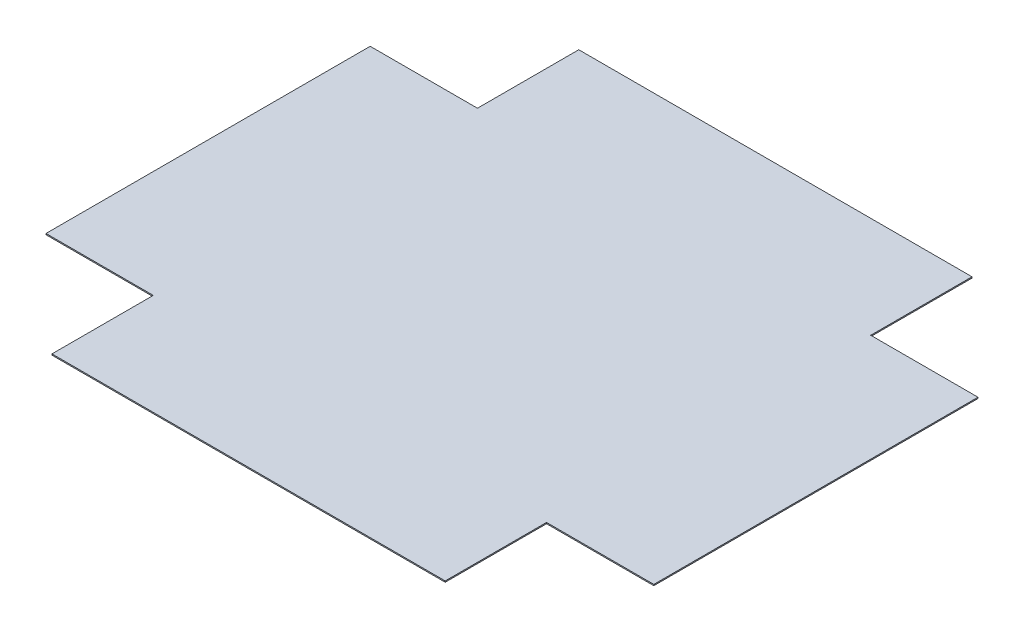
ISO-10303-21;
HEADER;
FILE_DESCRIPTION(('STEP AP214'),'2;1');
FILE_NAME('part.step','',(''),(''),'','','');
FILE_SCHEMA(('AUTOMOTIVE_DESIGN { 1 0 10303 214 1 1 1 1 }'));
ENDSEC;
DATA;
#1=APPLICATION_CONTEXT('core data for automotive mechanical design processes');
#2=APPLICATION_PROTOCOL_DEFINITION('international standard','automotive_design',2000,#1);
#3=PRODUCT_CONTEXT('',#1,'mechanical');
#4=PRODUCT('Part','Part','',(#3));
#5=PRODUCT_RELATED_PRODUCT_CATEGORY('part','',(#4));
#6=PRODUCT_DEFINITION_FORMATION('','',#4);
#7=PRODUCT_DEFINITION_CONTEXT('part definition',#1,'design');
#8=PRODUCT_DEFINITION('design','',#6,#7);
#9=PRODUCT_DEFINITION_SHAPE('','',#8);
#10=(LENGTH_UNIT() NAMED_UNIT(*) SI_UNIT(.MILLI.,.METRE.));
#11=(NAMED_UNIT(*) PLANE_ANGLE_UNIT() SI_UNIT($,.RADIAN.));
#12=(NAMED_UNIT(*) SI_UNIT($,.STERADIAN.) SOLID_ANGLE_UNIT());
#13=UNCERTAINTY_MEASURE_WITH_UNIT(LENGTH_MEASURE(1.E-05),#10,'distance_accuracy_value','');
#14=(GEOMETRIC_REPRESENTATION_CONTEXT(3) GLOBAL_UNCERTAINTY_ASSIGNED_CONTEXT((#13)) GLOBAL_UNIT_ASSIGNED_CONTEXT((#10,
#11,#12)) REPRESENTATION_CONTEXT('',''));
#15=CARTESIAN_POINT('',(0.,0.,0.));
#16=DIRECTION('',(0.,0.,1.));
#17=DIRECTION('',(1.,0.,0.));
#18=AXIS2_PLACEMENT_3D('',#15,#16,#17);
#19=CARTESIAN_POINT('',(127.,-0.7366,-101.6));
#20=DIRECTION('',(0.,0.,-1.));
#21=DIRECTION('',(-1.,0.,0.));
#22=AXIS2_PLACEMENT_3D('',#19,#20,#21);
#23=PLANE('',#22);
#24=DIRECTION('',(-1.,0.,0.));
#25=VECTOR('',#24,1.);
#26=CARTESIAN_POINT('',(127.,0.,-101.6));
#27=LINE('',#26,#25);
#28=CARTESIAN_POINT('',(190.5,0.,-101.6));
#29=VERTEX_POINT('',#28);
#30=CARTESIAN_POINT('',(123.25,0.,-101.6));
#31=VERTEX_POINT('',#30);
#32=EDGE_CURVE('E187',#29,#31,#27,.T.);
#33=ORIENTED_EDGE('',*,*,#32,.F.);
#34=DIRECTION('',(0.,1.,0.));
#35=VECTOR('',#34,1.);
#36=CARTESIAN_POINT('',(190.5,-0.7366,-101.6));
#37=LINE('',#36,#35);
#38=CARTESIAN_POINT('',(190.5,-0.7366,-101.6));
#39=VERTEX_POINT('',#38);
#40=EDGE_CURVE('E11',#39,#29,#37,.T.);
#41=ORIENTED_EDGE('',*,*,#40,.F.);
#42=DIRECTION('',(-1.,0.,0.));
#43=VECTOR('',#42,1.);
#44=CARTESIAN_POINT('',(127.,-0.7366,-101.6));
#45=LINE('',#44,#43);
#46=CARTESIAN_POINT('',(123.25,-0.7366,-101.6));
#47=VERTEX_POINT('',#46);
#48=EDGE_CURVE('E54',#39,#47,#45,.T.);
#49=ORIENTED_EDGE('',*,*,#48,.T.);
#50=DIRECTION('',(0.,1.,0.));
#51=VECTOR('',#50,1.);
#52=CARTESIAN_POINT('',(123.25,-0.7366,-101.6));
#53=LINE('',#52,#51);
#54=EDGE_CURVE('E39',#47,#31,#53,.T.);
#55=ORIENTED_EDGE('',*,*,#54,.T.);
#56=EDGE_LOOP('',(#33,#41,#49,#55));
#57=FACE_BOUND('',#56,.T.);
#58=ADVANCED_FACE('F35',(#57),#23,.T.);
#59=CARTESIAN_POINT('',(190.5,-0.7366,-101.6));
#60=DIRECTION('',(1.,0.,0.));
#61=DIRECTION('',(0.,0.,-1.));
#62=AXIS2_PLACEMENT_3D('',#59,#60,#61);
#63=PLANE('',#62);
#64=DIRECTION('',(0.,0.,-1.));
#65=VECTOR('',#64,1.);
#66=CARTESIAN_POINT('',(190.5,0.,-101.6));
#67=LINE('',#66,#65);
#68=CARTESIAN_POINT('',(190.5,0.,101.6));
#69=VERTEX_POINT('',#68);
#70=EDGE_CURVE('E185',#69,#29,#67,.T.);
#71=ORIENTED_EDGE('',*,*,#70,.F.);
#72=DIRECTION('',(0.,1.,0.));
#73=VECTOR('',#72,1.);
#74=CARTESIAN_POINT('',(190.5,-0.7366,101.6));
#75=LINE('',#74,#73);
#76=CARTESIAN_POINT('',(190.5,-0.7366,101.6));
#77=VERTEX_POINT('',#76);
#78=EDGE_CURVE('E45',#77,#69,#75,.T.);
#79=ORIENTED_EDGE('',*,*,#78,.F.);
#80=DIRECTION('',(0.,0.,-1.));
#81=VECTOR('',#80,1.);
#82=CARTESIAN_POINT('',(190.5,-0.7366,-101.6));
#83=LINE('',#82,#81);
#84=EDGE_CURVE('E148',#77,#39,#83,.T.);
#85=ORIENTED_EDGE('',*,*,#84,.T.);
#86=ORIENTED_EDGE('',*,*,#40,.T.);
#87=EDGE_LOOP('',(#71,#79,#85,#86));
#88=FACE_BOUND('',#87,.T.);
#89=ADVANCED_FACE('F210',(#88),#63,.T.);
#90=CARTESIAN_POINT('',(190.5,-0.7366,101.6));
#91=DIRECTION('',(0.,0.,1.));
#92=DIRECTION('',(1.,0.,0.));
#93=AXIS2_PLACEMENT_3D('',#90,#91,#92);
#94=PLANE('',#93);
#95=DIRECTION('',(1.,0.,0.));
#96=VECTOR('',#95,1.);
#97=CARTESIAN_POINT('',(190.5,0.,101.6));
#98=LINE('',#97,#96);
#99=CARTESIAN_POINT('',(123.25,0.,101.6));
#100=VERTEX_POINT('',#99);
#101=EDGE_CURVE('E136',#100,#69,#98,.T.);
#102=ORIENTED_EDGE('',*,*,#101,.F.);
#103=DIRECTION('',(0.,1.,0.));
#104=VECTOR('',#103,1.);
#105=CARTESIAN_POINT('',(123.25,-0.7366,101.6));
#106=LINE('',#105,#104);
#107=CARTESIAN_POINT('',(123.25,-0.7366,101.6));
#108=VERTEX_POINT('',#107);
#109=EDGE_CURVE('E131',#108,#100,#106,.T.);
#110=ORIENTED_EDGE('',*,*,#109,.F.);
#111=DIRECTION('',(1.,0.,0.));
#112=VECTOR('',#111,1.);
#113=CARTESIAN_POINT('',(127.,-0.7366,101.6));
#114=LINE('',#113,#112);
#115=EDGE_CURVE('E134',#108,#77,#114,.T.);
#116=ORIENTED_EDGE('',*,*,#115,.T.);
#117=ORIENTED_EDGE('',*,*,#78,.T.);
#118=EDGE_LOOP('',(#102,#110,#116,#117));
#119=FACE_BOUND('',#118,.T.);
#120=ADVANCED_FACE('F133',(#119),#94,.T.);
#121=CARTESIAN_POINT('',(123.25,-0.7366,101.6));
#122=DIRECTION('',(1.,0.,0.));
#123=DIRECTION('',(0.,0.,-1.));
#124=AXIS2_PLACEMENT_3D('',#121,#122,#123);
#125=PLANE('',#124);
#126=DIRECTION('',(0.,0.,-1.));
#127=VECTOR('',#126,1.);
#128=CARTESIAN_POINT('',(123.25,0.,101.6));
#129=LINE('',#128,#127);
#130=CARTESIAN_POINT('',(123.25,0.,165.1));
#131=VERTEX_POINT('',#130);
#132=EDGE_CURVE('E182',#131,#100,#129,.T.);
#133=ORIENTED_EDGE('',*,*,#132,.F.);
#134=DIRECTION('',(0.,1.,0.));
#135=VECTOR('',#134,1.);
#136=CARTESIAN_POINT('',(123.25,-0.7366,165.1));
#137=LINE('',#136,#135);
#138=CARTESIAN_POINT('',(123.25,-0.7366,165.1));
#139=VERTEX_POINT('',#138);
#140=EDGE_CURVE('E141',#139,#131,#137,.T.);
#141=ORIENTED_EDGE('',*,*,#140,.F.);
#142=DIRECTION('',(0.,0.,-1.));
#143=VECTOR('',#142,1.);
#144=CARTESIAN_POINT('',(123.25,-0.7366,101.6));
#145=LINE('',#144,#143);
#146=EDGE_CURVE('E146',#139,#108,#145,.T.);
#147=ORIENTED_EDGE('',*,*,#146,.T.);
#148=ORIENTED_EDGE('',*,*,#109,.T.);
#149=EDGE_LOOP('',(#133,#141,#147,#148));
#150=FACE_BOUND('',#149,.T.);
#151=ADVANCED_FACE('F150',(#150),#125,.T.);
#152=CARTESIAN_POINT('',(123.25,-0.7366,165.1));
#153=DIRECTION('',(0.,0.,1.));
#154=DIRECTION('',(1.,0.,0.));
#155=AXIS2_PLACEMENT_3D('',#152,#153,#154);
#156=PLANE('',#155);
#157=DIRECTION('',(1.,0.,0.));
#158=VECTOR('',#157,1.);
#159=CARTESIAN_POINT('',(123.25,0.,165.1));
#160=LINE('',#159,#158);
#161=CARTESIAN_POINT('',(-123.25,0.,165.1));
#162=VERTEX_POINT('',#161);
#163=EDGE_CURVE('E179',#162,#131,#160,.T.);
#164=ORIENTED_EDGE('',*,*,#163,.F.);
#165=DIRECTION('',(0.,1.,0.));
#166=VECTOR('',#165,1.);
#167=CARTESIAN_POINT('',(-123.25,-0.7366,165.1));
#168=LINE('',#167,#166);
#169=CARTESIAN_POINT('',(-123.25,-0.7366,165.1));
#170=VERTEX_POINT('',#169);
#171=EDGE_CURVE('E191',#170,#162,#168,.T.);
#172=ORIENTED_EDGE('',*,*,#171,.F.);
#173=DIRECTION('',(1.,0.,0.));
#174=VECTOR('',#173,1.);
#175=CARTESIAN_POINT('',(123.25,-0.7366,165.1));
#176=LINE('',#175,#174);
#177=EDGE_CURVE('E151',#170,#139,#176,.T.);
#178=ORIENTED_EDGE('',*,*,#177,.T.);
#179=ORIENTED_EDGE('',*,*,#140,.T.);
#180=EDGE_LOOP('',(#164,#172,#178,#179));
#181=FACE_BOUND('',#180,.T.);
#182=ADVANCED_FACE('F223',(#181),#156,.T.);
#183=CARTESIAN_POINT('',(-123.25,-0.7366,101.6));
#184=DIRECTION('',(-1.,0.,0.));
#185=DIRECTION('',(0.,0.,1.));
#186=AXIS2_PLACEMENT_3D('',#183,#184,#185);
#187=PLANE('',#186);
#188=DIRECTION('',(0.,0.,1.));
#189=VECTOR('',#188,1.);
#190=CARTESIAN_POINT('',(-123.25,0.,101.6));
#191=LINE('',#190,#189);
#192=CARTESIAN_POINT('',(-123.25,0.,101.6));
#193=VERTEX_POINT('',#192);
#194=EDGE_CURVE('E176',#193,#162,#191,.T.);
#195=ORIENTED_EDGE('',*,*,#194,.F.);
#196=DIRECTION('',(0.,1.,0.));
#197=VECTOR('',#196,1.);
#198=CARTESIAN_POINT('',(-123.25,-0.7366,101.6));
#199=LINE('',#198,#197);
#200=CARTESIAN_POINT('',(-123.25,-0.7366,101.6));
#201=VERTEX_POINT('',#200);
#202=EDGE_CURVE('E193',#201,#193,#199,.T.);
#203=ORIENTED_EDGE('',*,*,#202,.F.);
#204=DIRECTION('',(0.,0.,1.));
#205=VECTOR('',#204,1.);
#206=CARTESIAN_POINT('',(-123.25,-0.7366,101.6));
#207=LINE('',#206,#205);
#208=EDGE_CURVE('E153',#201,#170,#207,.T.);
#209=ORIENTED_EDGE('',*,*,#208,.T.);
#210=ORIENTED_EDGE('',*,*,#171,.T.);
#211=EDGE_LOOP('',(#195,#203,#209,#210));
#212=FACE_BOUND('',#211,.T.);
#213=ADVANCED_FACE('F226',(#212),#187,.T.);
#214=CARTESIAN_POINT('',(-127.,-0.7366,101.6));
#215=DIRECTION('',(0.,0.,1.));
#216=DIRECTION('',(1.,0.,0.));
#217=AXIS2_PLACEMENT_3D('',#214,#215,#216);
#218=PLANE('',#217);
#219=DIRECTION('',(1.,0.,0.));
#220=VECTOR('',#219,1.);
#221=CARTESIAN_POINT('',(-127.,0.,101.6));
#222=LINE('',#221,#220);
#223=CARTESIAN_POINT('',(-190.5,0.,101.6));
#224=VERTEX_POINT('',#223);
#225=EDGE_CURVE('E173',#224,#193,#222,.T.);
#226=ORIENTED_EDGE('',*,*,#225,.F.);
#227=DIRECTION('',(0.,1.,0.));
#228=VECTOR('',#227,1.);
#229=CARTESIAN_POINT('',(-190.5,-0.7366,101.6));
#230=LINE('',#229,#228);
#231=CARTESIAN_POINT('',(-190.5,-0.7366,101.6));
#232=VERTEX_POINT('',#231);
#233=EDGE_CURVE('E195',#232,#224,#230,.T.);
#234=ORIENTED_EDGE('',*,*,#233,.F.);
#235=DIRECTION('',(1.,0.,0.));
#236=VECTOR('',#235,1.);
#237=CARTESIAN_POINT('',(-127.,-0.7366,101.6));
#238=LINE('',#237,#236);
#239=EDGE_CURVE('E266',#232,#201,#238,.T.);
#240=ORIENTED_EDGE('',*,*,#239,.T.);
#241=ORIENTED_EDGE('',*,*,#202,.T.);
#242=EDGE_LOOP('',(#226,#234,#240,#241));
#243=FACE_BOUND('',#242,.T.);
#244=ADVANCED_FACE('F230',(#243),#218,.T.);
#245=CARTESIAN_POINT('',(-190.5,-0.7366,101.6));
#246=DIRECTION('',(-1.,0.,0.));
#247=DIRECTION('',(0.,0.,1.));
#248=AXIS2_PLACEMENT_3D('',#245,#246,#247);
#249=PLANE('',#248);
#250=DIRECTION('',(0.,0.,1.));
#251=VECTOR('',#250,1.);
#252=CARTESIAN_POINT('',(-190.5,0.,101.6));
#253=LINE('',#252,#251);
#254=CARTESIAN_POINT('',(-190.5,0.,-101.6));
#255=VERTEX_POINT('',#254);
#256=EDGE_CURVE('E170',#255,#224,#253,.T.);
#257=ORIENTED_EDGE('',*,*,#256,.F.);
#258=DIRECTION('',(0.,1.,0.));
#259=VECTOR('',#258,1.);
#260=CARTESIAN_POINT('',(-190.5,-0.7366,-101.6));
#261=LINE('',#260,#259);
#262=CARTESIAN_POINT('',(-190.5,-0.7366,-101.6));
#263=VERTEX_POINT('',#262);
#264=EDGE_CURVE('E198',#263,#255,#261,.T.);
#265=ORIENTED_EDGE('',*,*,#264,.F.);
#266=DIRECTION('',(0.,0.,1.));
#267=VECTOR('',#266,1.);
#268=CARTESIAN_POINT('',(-190.5,-0.7366,101.6));
#269=LINE('',#268,#267);
#270=EDGE_CURVE('E264',#263,#232,#269,.T.);
#271=ORIENTED_EDGE('',*,*,#270,.T.);
#272=ORIENTED_EDGE('',*,*,#233,.T.);
#273=EDGE_LOOP('',(#257,#265,#271,#272));
#274=FACE_BOUND('',#273,.T.);
#275=ADVANCED_FACE('F234',(#274),#249,.T.);
#276=CARTESIAN_POINT('',(-190.5,-0.7366,-101.6));
#277=DIRECTION('',(0.,0.,-1.));
#278=DIRECTION('',(-1.,0.,0.));
#279=AXIS2_PLACEMENT_3D('',#276,#277,#278);
#280=PLANE('',#279);
#281=DIRECTION('',(-1.,0.,0.));
#282=VECTOR('',#281,1.);
#283=CARTESIAN_POINT('',(-190.5,0.,-101.6));
#284=LINE('',#283,#282);
#285=CARTESIAN_POINT('',(-123.25,0.,-101.6));
#286=VERTEX_POINT('',#285);
#287=EDGE_CURVE('E167',#286,#255,#284,.T.);
#288=ORIENTED_EDGE('',*,*,#287,.F.);
#289=DIRECTION('',(0.,1.,0.));
#290=VECTOR('',#289,1.);
#291=CARTESIAN_POINT('',(-123.25,-0.7366,-101.6));
#292=LINE('',#291,#290);
#293=CARTESIAN_POINT('',(-123.25,-0.7366,-101.6));
#294=VERTEX_POINT('',#293);
#295=EDGE_CURVE('E200',#294,#286,#292,.T.);
#296=ORIENTED_EDGE('',*,*,#295,.F.);
#297=DIRECTION('',(-1.,0.,0.));
#298=VECTOR('',#297,1.);
#299=CARTESIAN_POINT('',(-127.,-0.7366,-101.6));
#300=LINE('',#299,#298);
#301=EDGE_CURVE('E261',#294,#263,#300,.T.);
#302=ORIENTED_EDGE('',*,*,#301,.T.);
#303=ORIENTED_EDGE('',*,*,#264,.T.);
#304=EDGE_LOOP('',(#288,#296,#302,#303));
#305=FACE_BOUND('',#304,.T.);
#306=ADVANCED_FACE('F238',(#305),#280,.T.);
#307=CARTESIAN_POINT('',(-123.25,-0.7366,-101.6));
#308=DIRECTION('',(-1.,0.,0.));
#309=DIRECTION('',(0.,0.,1.));
#310=AXIS2_PLACEMENT_3D('',#307,#308,#309);
#311=PLANE('',#310);
#312=DIRECTION('',(0.,0.,1.));
#313=VECTOR('',#312,1.);
#314=CARTESIAN_POINT('',(-123.25,0.,-101.6));
#315=LINE('',#314,#313);
#316=CARTESIAN_POINT('',(-123.25,0.,-165.1));
#317=VERTEX_POINT('',#316);
#318=EDGE_CURVE('E164',#317,#286,#315,.T.);
#319=ORIENTED_EDGE('',*,*,#318,.F.);
#320=DIRECTION('',(0.,1.,0.));
#321=VECTOR('',#320,1.);
#322=CARTESIAN_POINT('',(-123.25,-0.7366,-165.1));
#323=LINE('',#322,#321);
#324=CARTESIAN_POINT('',(-123.25,-0.7366,-165.1));
#325=VERTEX_POINT('',#324);
#326=EDGE_CURVE('E203',#325,#317,#323,.T.);
#327=ORIENTED_EDGE('',*,*,#326,.F.);
#328=DIRECTION('',(0.,0.,1.));
#329=VECTOR('',#328,1.);
#330=CARTESIAN_POINT('',(-123.25,-0.7366,-101.6));
#331=LINE('',#330,#329);
#332=EDGE_CURVE('E274',#325,#294,#331,.T.);
#333=ORIENTED_EDGE('',*,*,#332,.T.);
#334=ORIENTED_EDGE('',*,*,#295,.T.);
#335=EDGE_LOOP('',(#319,#327,#333,#334));
#336=FACE_BOUND('',#335,.T.);
#337=ADVANCED_FACE('F242',(#336),#311,.T.);
#338=CARTESIAN_POINT('',(-123.25,-0.7366,-165.1));
#339=DIRECTION('',(0.,0.,-1.));
#340=DIRECTION('',(-1.,0.,0.));
#341=AXIS2_PLACEMENT_3D('',#338,#339,#340);
#342=PLANE('',#341);
#343=DIRECTION('',(-1.,0.,0.));
#344=VECTOR('',#343,1.);
#345=CARTESIAN_POINT('',(-123.25,0.,-165.1));
#346=LINE('',#345,#344);
#347=CARTESIAN_POINT('',(123.25,0.,-165.1));
#348=VERTEX_POINT('',#347);
#349=EDGE_CURVE('E161',#348,#317,#346,.T.);
#350=ORIENTED_EDGE('',*,*,#349,.F.);
#351=DIRECTION('',(0.,1.,0.));
#352=VECTOR('',#351,1.);
#353=CARTESIAN_POINT('',(123.25,-0.7366,-165.1));
#354=LINE('',#353,#352);
#355=CARTESIAN_POINT('',(123.25,-0.7366,-165.1));
#356=VERTEX_POINT('',#355);
#357=EDGE_CURVE('E204',#356,#348,#354,.T.);
#358=ORIENTED_EDGE('',*,*,#357,.F.);
#359=DIRECTION('',(-1.,0.,0.));
#360=VECTOR('',#359,1.);
#361=CARTESIAN_POINT('',(-123.25,-0.7366,-165.1));
#362=LINE('',#361,#360);
#363=EDGE_CURVE('E255',#356,#325,#362,.T.);
#364=ORIENTED_EDGE('',*,*,#363,.T.);
#365=ORIENTED_EDGE('',*,*,#326,.T.);
#366=EDGE_LOOP('',(#350,#358,#364,#365));
#367=FACE_BOUND('',#366,.T.);
#368=ADVANCED_FACE('F245',(#367),#342,.T.);
#369=CARTESIAN_POINT('',(123.25,-0.7366,-101.6));
#370=DIRECTION('',(1.,0.,0.));
#371=DIRECTION('',(0.,0.,-1.));
#372=AXIS2_PLACEMENT_3D('',#369,#370,#371);
#373=PLANE('',#372);
#374=DIRECTION('',(0.,0.,-1.));
#375=VECTOR('',#374,1.);
#376=CARTESIAN_POINT('',(123.25,0.,-101.6));
#377=LINE('',#376,#375);
#378=EDGE_CURVE('E158',#31,#348,#377,.T.);
#379=ORIENTED_EDGE('',*,*,#378,.F.);
#380=ORIENTED_EDGE('',*,*,#54,.F.);
#381=DIRECTION('',(0.,0.,-1.));
#382=VECTOR('',#381,1.);
#383=CARTESIAN_POINT('',(123.25,-0.7366,-101.6));
#384=LINE('',#383,#382);
#385=EDGE_CURVE('E277',#47,#356,#384,.T.);
#386=ORIENTED_EDGE('',*,*,#385,.T.);
#387=ORIENTED_EDGE('',*,*,#357,.T.);
#388=EDGE_LOOP('',(#379,#380,#386,#387));
#389=FACE_BOUND('',#388,.T.);
#390=ADVANCED_FACE('F37',(#389),#373,.T.);
#391=CARTESIAN_POINT('',(0.,-0.7366,0.));
#392=DIRECTION('',(0.,-1.,0.));
#393=DIRECTION('',(0.,0.,-1.));
#394=AXIS2_PLACEMENT_3D('',#391,#392,#393);
#395=PLANE('',#394);
#396=ORIENTED_EDGE('',*,*,#48,.F.);
#397=ORIENTED_EDGE('',*,*,#84,.F.);
#398=ORIENTED_EDGE('',*,*,#115,.F.);
#399=ORIENTED_EDGE('',*,*,#146,.F.);
#400=ORIENTED_EDGE('',*,*,#177,.F.);
#401=ORIENTED_EDGE('',*,*,#208,.F.);
#402=ORIENTED_EDGE('',*,*,#239,.F.);
#403=ORIENTED_EDGE('',*,*,#270,.F.);
#404=ORIENTED_EDGE('',*,*,#301,.F.);
#405=ORIENTED_EDGE('',*,*,#332,.F.);
#406=ORIENTED_EDGE('',*,*,#363,.F.);
#407=ORIENTED_EDGE('',*,*,#385,.F.);
#408=EDGE_LOOP('',(#396,#397,#398,#399,#400,#401,#402,#403,#404,#405,#406,#407));
#409=FACE_BOUND('',#408,.T.);
#410=ADVANCED_FACE('F144',(#409),#395,.T.);
#411=CARTESIAN_POINT('',(0.,0.,0.));
#412=DIRECTION('',(0.,-1.,0.));
#413=DIRECTION('',(0.,0.,-1.));
#414=AXIS2_PLACEMENT_3D('',#411,#412,#413);
#415=PLANE('',#414);
#416=ORIENTED_EDGE('',*,*,#32,.T.);
#417=ORIENTED_EDGE('',*,*,#378,.T.);
#418=ORIENTED_EDGE('',*,*,#349,.T.);
#419=ORIENTED_EDGE('',*,*,#318,.T.);
#420=ORIENTED_EDGE('',*,*,#287,.T.);
#421=ORIENTED_EDGE('',*,*,#256,.T.);
#422=ORIENTED_EDGE('',*,*,#225,.T.);
#423=ORIENTED_EDGE('',*,*,#194,.T.);
#424=ORIENTED_EDGE('',*,*,#163,.T.);
#425=ORIENTED_EDGE('',*,*,#132,.T.);
#426=ORIENTED_EDGE('',*,*,#101,.T.);
#427=ORIENTED_EDGE('',*,*,#70,.T.);
#428=EDGE_LOOP('',(#416,#417,#418,#419,#420,#421,#422,#423,#424,#425,#426,#427));
#429=FACE_BOUND('',#428,.T.);
#430=ADVANCED_FACE('F209',(#429),#415,.F.);
#431=CLOSED_SHELL('',(#58,#89,#120,#151,#182,#213,#244,#275,#306,#337,#368,#390,#410,#430));
#432=MANIFOLD_SOLID_BREP('B2',#431);
#433=ADVANCED_BREP_SHAPE_REPRESENTATION('',(#18,#432),#14);
#434=SHAPE_DEFINITION_REPRESENTATION(#9,#433);
ENDSEC;
END-ISO-10303-21;
